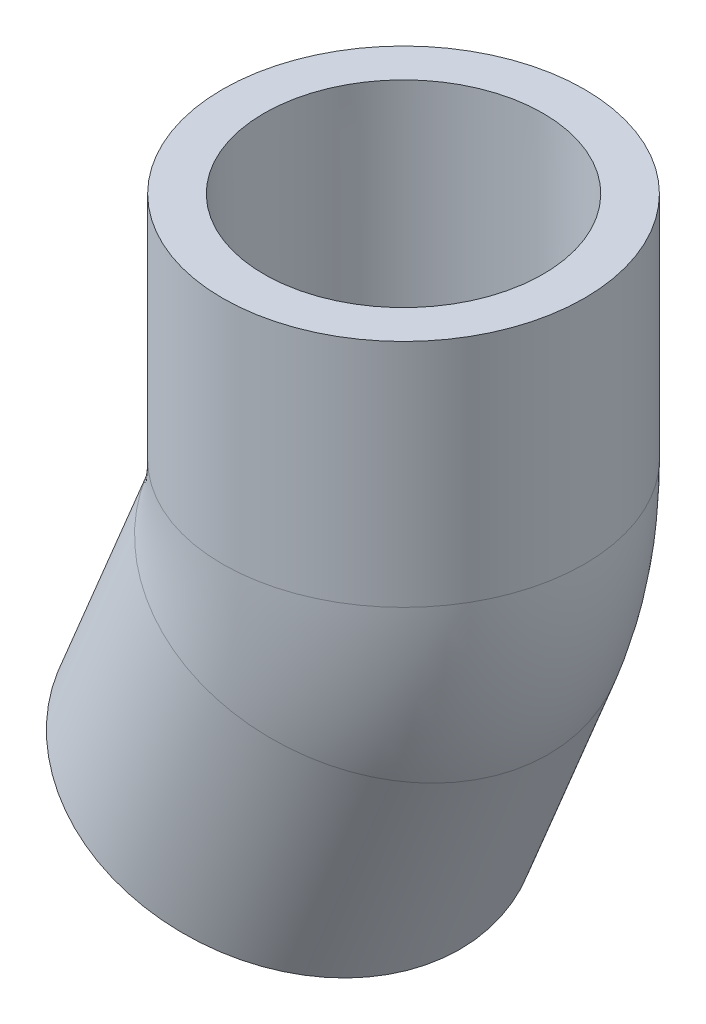
ISO-10303-21;
HEADER;
FILE_DESCRIPTION(('STEP AP214'),'2;1');
FILE_NAME('part.step','',(''),(''),'','','');
FILE_SCHEMA(('AUTOMOTIVE_DESIGN { 1 0 10303 214 1 1 1 1 }'));
ENDSEC;
DATA;
#1=APPLICATION_CONTEXT('core data for automotive mechanical design processes');
#2=APPLICATION_PROTOCOL_DEFINITION('international standard','automotive_design',2000,#1);
#3=PRODUCT_CONTEXT('',#1,'mechanical');
#4=PRODUCT('Part','Part','',(#3));
#5=PRODUCT_RELATED_PRODUCT_CATEGORY('part','',(#4));
#6=PRODUCT_DEFINITION_FORMATION('','',#4);
#7=PRODUCT_DEFINITION_CONTEXT('part definition',#1,'design');
#8=PRODUCT_DEFINITION('design','',#6,#7);
#9=PRODUCT_DEFINITION_SHAPE('','',#8);
#10=(LENGTH_UNIT() NAMED_UNIT(*) SI_UNIT(.MILLI.,.METRE.));
#11=(NAMED_UNIT(*) PLANE_ANGLE_UNIT() SI_UNIT($,.RADIAN.));
#12=(NAMED_UNIT(*) SI_UNIT($,.STERADIAN.) SOLID_ANGLE_UNIT());
#13=UNCERTAINTY_MEASURE_WITH_UNIT(LENGTH_MEASURE(1.E-05),#10,'distance_accuracy_value','');
#14=(GEOMETRIC_REPRESENTATION_CONTEXT(3) GLOBAL_UNCERTAINTY_ASSIGNED_CONTEXT((#13)) GLOBAL_UNIT_ASSIGNED_CONTEXT((#10,
#11,#12)) REPRESENTATION_CONTEXT('',''));
#15=CARTESIAN_POINT('',(0.,0.,0.));
#16=DIRECTION('',(0.,0.,1.));
#17=DIRECTION('',(1.,0.,0.));
#18=AXIS2_PLACEMENT_3D('',#15,#16,#17);
#19=CARTESIAN_POINT('',(6.80133904524714,-40.6197544700509,0.));
#20=DIRECTION('',(-0.382683432365091,-0.923879532511287,0.));
#21=DIRECTION('',(0.923879532511287,-0.382683432365091,0.));
#22=AXIS2_PLACEMENT_3D('',#19,#20,#21);
#23=PLANE('',#22);
#24=CARTESIAN_POINT('',(-13.3652188753508,-32.2664926729567,0.));
#25=DIRECTION('',(-0.382683432365091,-0.923879532511287,0.));
#26=DIRECTION('',(0.923879532511287,-0.382683432365091,0.));
#27=AXIS2_PLACEMENT_3D('',#24,#25,#26);
#28=CIRCLE('',#27,21.828125);
#29=CARTESIAN_POINT('',(6.80133904524715,-40.6197544700509,0.));
#30=VERTEX_POINT('',#29);
#31=EDGE_CURVE('E49',#30,#30,#28,.T.);
#32=ORIENTED_EDGE('',*,*,#31,.T.);
#33=EDGE_LOOP('',(#32));
#34=FACE_BOUND('',#33,.T.);
#35=CARTESIAN_POINT('',(-13.3652188753508,-32.2664926729567,0.));
#36=DIRECTION('',(-0.382683432365091,-0.923879532511287,0.));
#37=DIRECTION('',(0.923879532511287,-0.382683432365091,0.));
#38=AXIS2_PLACEMENT_3D('',#35,#36,#37);
#39=CIRCLE('',#38,16.8275);
#40=CARTESIAN_POINT('',(2.18136395798289,-38.7060981310803,0.));
#41=VERTEX_POINT('',#40);
#42=EDGE_CURVE('E36',#41,#41,#39,.T.);
#43=ORIENTED_EDGE('',*,*,#42,.F.);
#44=EDGE_LOOP('',(#43));
#45=FACE_BOUND('',#44,.T.);
#46=ADVANCED_FACE('F30',(#34,#45),#23,.T.);
#47=CARTESIAN_POINT('',(-2.73379476995811,-6.5999644103775,0.));
#48=DIRECTION('',(-0.382683432365091,-0.923879532511287,0.));
#49=DIRECTION('',(0.923879532511287,-0.382683432365091,0.));
#50=AXIS2_PLACEMENT_3D('',#47,#48,#49);
#51=CONICAL_SURFACE('',#50,16.637,0.00685703538495645);
#52=ORIENTED_EDGE('',*,*,#42,.T.);
#53=EDGE_LOOP('',(#52));
#54=FACE_BOUND('',#53,.T.);
#55=CARTESIAN_POINT('',(-2.73379476995811,-6.5999644103775,0.));
#56=DIRECTION('',(-0.382683432365091,-0.923879532511287,0.));
#57=DIRECTION('',(0.923879532511287,-0.382683432365091,0.));
#58=AXIS2_PLACEMENT_3D('',#55,#56,#57);
#59=CIRCLE('',#58,16.637);
#60=CARTESIAN_POINT('',(12.6367890124322,-12.9666686746355,0.));
#61=VERTEX_POINT('',#60);
#62=EDGE_CURVE('E40',#61,#61,#59,.T.);
#63=ORIENTED_EDGE('',*,*,#62,.F.);
#64=EDGE_LOOP('',(#63));
#65=FACE_BOUND('',#64,.T.);
#66=ADVANCED_FACE('F81',(#54,#65),#51,.F.);
#67=CARTESIAN_POINT('',(-13.3652188753508,-32.2664926729567,0.));
#68=DIRECTION('',(-0.382683432365091,-0.923879532511287,0.));
#69=DIRECTION('',(0.923879532511287,-0.382683432365091,0.));
#70=AXIS2_PLACEMENT_3D('',#67,#68,#69);
#71=CYLINDRICAL_SURFACE('',#70,21.828125);
#72=CARTESIAN_POINT('',(-2.73379476995811,-6.59996441037749,0.));
#73=DIRECTION('',(-0.382683432365091,-0.923879532511287,0.));
#74=DIRECTION('',(0.923879532511287,-0.382683432365091,0.));
#75=AXIS2_PLACEMENT_3D('',#72,#73,#74);
#76=CIRCLE('',#75,21.828125);
#77=CARTESIAN_POINT('',(17.4327631506398,-14.9532262074717,0.));
#78=VERTEX_POINT('',#77);
#79=EDGE_CURVE('E44',#78,#78,#76,.T.);
#80=ORIENTED_EDGE('',*,*,#79,.T.);
#81=EDGE_LOOP('',(#80));
#82=FACE_BOUND('',#81,.T.);
#83=ORIENTED_EDGE('',*,*,#31,.F.);
#84=EDGE_LOOP('',(#83));
#85=FACE_BOUND('',#84,.T.);
#86=ADVANCED_FACE('F86',(#82,#85),#71,.T.);
#87=CARTESIAN_POINT('',(-35.9140564968739,7.14374999999999,0.));
#88=DIRECTION('',(0.,0.,-1.));
#89=DIRECTION('',(-1.,0.,0.));
#90=AXIS2_PLACEMENT_3D('',#87,#88,#89);
#91=TOROIDAL_SURFACE('',#90,35.9140564968739,13.3223);
#92=CARTESIAN_POINT('',(0.,7.14374999999998,0.));
#93=DIRECTION('',(0.,1.,0.));
#94=DIRECTION('',(-1.,0.,0.));
#95=AXIS2_PLACEMENT_3D('',#92,#93,#94);
#96=CIRCLE('',#95,13.3223);
#97=CARTESIAN_POINT('',(13.3223,7.14374999999998,0.));
#98=VERTEX_POINT('',#97);
#99=EDGE_CURVE('E55',#98,#98,#96,.T.);
#100=CARTESIAN_POINT('',(-2.73379476995812,-6.5999644103775,0.));
#101=DIRECTION('',(0.382683432365091,0.923879532511287,0.));
#102=DIRECTION('',(-0.923879532511287,0.382683432365091,0.));
#103=AXIS2_PLACEMENT_3D('',#100,#101,#102);
#104=CIRCLE('',#103,13.3223);
#105=CARTESIAN_POINT('',(9.574405526017,-11.6981879013749,0.));
#106=VERTEX_POINT('',#105);
#107=EDGE_CURVE('E58',#106,#106,#104,.T.);
#108=CARTESIAN_POINT('',(-35.9140564968739,7.14374999999999,0.));
#109=DIRECTION('',(0.,0.,-1.));
#110=DIRECTION('',(-1.,0.,0.));
#111=AXIS2_PLACEMENT_3D('',#108,#109,#110);
#112=CIRCLE('',#111,49.2363564968739);
#113=EDGE_CURVE('',#98,#106,#112,.T.);
#114=ORIENTED_EDGE('',*,*,#99,.T.);
#115=ORIENTED_EDGE('',*,*,#107,.F.);
#116=ORIENTED_EDGE('',*,*,#113,.T.);
#117=ORIENTED_EDGE('',*,*,#113,.F.);
#118=EDGE_LOOP('',(#114,#116,#115,#117));
#119=FACE_BOUND('',#118,.T.);
#120=ADVANCED_FACE('F91',(#119),#91,.F.);
#121=CARTESIAN_POINT('',(-35.9140564968739,7.14374999999999,0.));
#122=DIRECTION('',(0.,0.,-1.));
#123=DIRECTION('',(-1.,0.,0.));
#124=AXIS2_PLACEMENT_3D('',#121,#122,#123);
#125=TOROIDAL_SURFACE('',#124,35.9140564968739,21.828125);
#126=CARTESIAN_POINT('',(0.,7.14374999999998,0.));
#127=DIRECTION('',(0.,1.,0.));
#128=DIRECTION('',(-1.,0.,0.));
#129=AXIS2_PLACEMENT_3D('',#126,#127,#128);
#130=CIRCLE('',#129,21.828125);
#131=CARTESIAN_POINT('',(21.828125,7.14374999999998,0.));
#132=VERTEX_POINT('',#131);
#133=EDGE_CURVE('E52',#132,#132,#130,.T.);
#134=CARTESIAN_POINT('',(-35.9140564968739,7.14374999999999,0.));
#135=DIRECTION('',(0.,0.,-1.));
#136=DIRECTION('',(-1.,0.,0.));
#137=AXIS2_PLACEMENT_3D('',#134,#135,#136);
#138=CIRCLE('',#137,57.7421814968739);
#139=EDGE_CURVE('',#132,#78,#138,.T.);
#140=ORIENTED_EDGE('',*,*,#133,.F.);
#141=ORIENTED_EDGE('',*,*,#79,.F.);
#142=ORIENTED_EDGE('',*,*,#139,.T.);
#143=ORIENTED_EDGE('',*,*,#139,.F.);
#144=EDGE_LOOP('',(#140,#142,#141,#143));
#145=FACE_BOUND('',#144,.T.);
#146=ADVANCED_FACE('F97',(#145),#125,.T.);
#147=CARTESIAN_POINT('',(0.,7.14374999999998,0.));
#148=DIRECTION('',(0.,1.,0.));
#149=DIRECTION('',(-1.,0.,0.));
#150=AXIS2_PLACEMENT_3D('',#147,#148,#149);
#151=PLANE('',#150);
#152=CARTESIAN_POINT('',(0.,7.14374999999998,0.));
#153=DIRECTION('',(0.,1.,0.));
#154=DIRECTION('',(-1.,0.,0.));
#155=AXIS2_PLACEMENT_3D('',#152,#153,#154);
#156=CIRCLE('',#155,16.637);
#157=CARTESIAN_POINT('',(-16.637,7.14374999999999,0.));
#158=VERTEX_POINT('',#157);
#159=EDGE_CURVE('E10',#158,#158,#156,.F.);
#160=ORIENTED_EDGE('',*,*,#159,.F.);
#161=EDGE_LOOP('',(#160));
#162=FACE_BOUND('',#161,.T.);
#163=ORIENTED_EDGE('',*,*,#99,.F.);
#164=EDGE_LOOP('',(#163));
#165=FACE_BOUND('',#164,.T.);
#166=ADVANCED_FACE('F100',(#162,#165),#151,.T.);
#167=CARTESIAN_POINT('',(-2.73379476995812,-6.5999644103775,0.));
#168=DIRECTION('',(0.382683432365091,0.923879532511287,0.));
#169=DIRECTION('',(-0.923879532511287,0.382683432365091,0.));
#170=AXIS2_PLACEMENT_3D('',#167,#168,#169);
#171=PLANE('',#170);
#172=ORIENTED_EDGE('',*,*,#62,.T.);
#173=EDGE_LOOP('',(#172));
#174=FACE_BOUND('',#173,.T.);
#175=ORIENTED_EDGE('',*,*,#107,.T.);
#176=EDGE_LOOP('',(#175));
#177=FACE_BOUND('',#176,.T.);
#178=ADVANCED_FACE('F104',(#174,#177),#171,.F.);
#179=CARTESIAN_POINT('',(21.828125,34.925,0.));
#180=DIRECTION('',(0.,1.,0.));
#181=DIRECTION('',(0.,0.,1.));
#182=AXIS2_PLACEMENT_3D('',#179,#180,#181);
#183=PLANE('',#182);
#184=CARTESIAN_POINT('',(0.,34.925,0.));
#185=DIRECTION('',(0.,-1.,0.));
#186=DIRECTION('',(0.,0.,-1.));
#187=AXIS2_PLACEMENT_3D('',#184,#185,#186);
#188=CIRCLE('',#187,16.8275);
#189=CARTESIAN_POINT('',(0.,34.925,-16.8275));
#190=VERTEX_POINT('',#189);
#191=EDGE_CURVE('E64',#190,#190,#188,.T.);
#192=ORIENTED_EDGE('',*,*,#191,.T.);
#193=EDGE_LOOP('',(#192));
#194=FACE_BOUND('',#193,.T.);
#195=CARTESIAN_POINT('',(0.,34.925,0.));
#196=DIRECTION('',(0.,-1.,0.));
#197=DIRECTION('',(0.,0.,-1.));
#198=AXIS2_PLACEMENT_3D('',#195,#196,#197);
#199=CIRCLE('',#198,21.828125);
#200=CARTESIAN_POINT('',(0.,34.925,-21.828125));
#201=VERTEX_POINT('',#200);
#202=EDGE_CURVE('E61',#201,#201,#199,.T.);
#203=ORIENTED_EDGE('',*,*,#202,.F.);
#204=EDGE_LOOP('',(#203));
#205=FACE_BOUND('',#204,.T.);
#206=ADVANCED_FACE('F68',(#194,#205),#183,.T.);
#207=CARTESIAN_POINT('',(0.,0.,0.));
#208=DIRECTION('',(0.,-1.,0.));
#209=DIRECTION('',(0.,0.,-1.));
#210=AXIS2_PLACEMENT_3D('',#207,#208,#209);
#211=CYLINDRICAL_SURFACE('',#210,21.828125);
#212=ORIENTED_EDGE('',*,*,#202,.T.);
#213=EDGE_LOOP('',(#212));
#214=FACE_BOUND('',#213,.T.);
#215=ORIENTED_EDGE('',*,*,#133,.T.);
#216=EDGE_LOOP('',(#215));
#217=FACE_BOUND('',#216,.T.);
#218=ADVANCED_FACE('F73',(#214,#217),#211,.T.);
#219=CARTESIAN_POINT('',(0.,34.925,0.));
#220=DIRECTION('',(0.,1.,0.));
#221=DIRECTION('',(0.,0.,1.));
#222=AXIS2_PLACEMENT_3D('',#219,#220,#221);
#223=CONICAL_SURFACE('',#222,16.8275,0.0068570353849562);
#224=ORIENTED_EDGE('',*,*,#159,.T.);
#225=EDGE_LOOP('',(#224));
#226=FACE_BOUND('',#225,.T.);
#227=ORIENTED_EDGE('',*,*,#191,.F.);
#228=EDGE_LOOP('',(#227));
#229=FACE_BOUND('',#228,.T.);
#230=ADVANCED_FACE('F71',(#226,#229),#223,.F.);
#231=CLOSED_SHELL('',(#46,#66,#86,#120,#146,#166,#178,#206,#218,#230));
#232=MANIFOLD_SOLID_BREP('B2',#231);
#233=ADVANCED_BREP_SHAPE_REPRESENTATION('',(#18,#232),#14);
#234=SHAPE_DEFINITION_REPRESENTATION(#9,#233);
ENDSEC;
END-ISO-10303-21;
